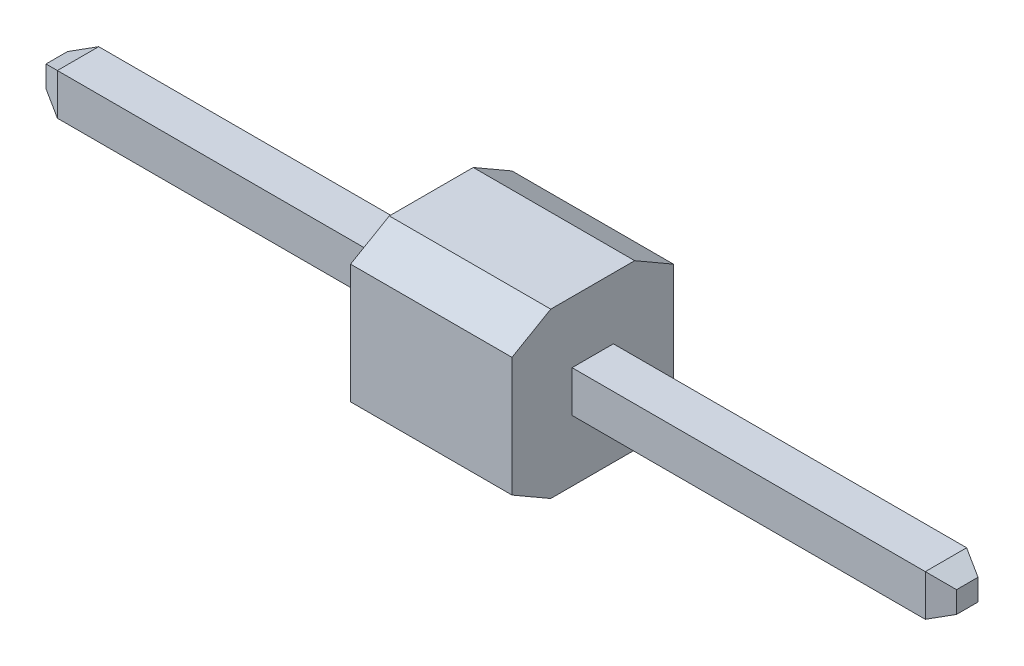
ISO-10303-21;
HEADER;
FILE_DESCRIPTION(('STEP AP214'),'2;1');
FILE_NAME('part.step','',(''),(''),'','','');
FILE_SCHEMA(('AUTOMOTIVE_DESIGN { 1 0 10303 214 1 1 1 1 }'));
ENDSEC;
DATA;
#1=APPLICATION_CONTEXT('core data for automotive mechanical design processes');
#2=APPLICATION_PROTOCOL_DEFINITION('international standard','automotive_design',2000,#1);
#3=PRODUCT_CONTEXT('',#1,'mechanical');
#4=PRODUCT('Part','Part','',(#3));
#5=PRODUCT_RELATED_PRODUCT_CATEGORY('part','',(#4));
#6=PRODUCT_DEFINITION_FORMATION('','',#4);
#7=PRODUCT_DEFINITION_CONTEXT('part definition',#1,'design');
#8=PRODUCT_DEFINITION('design','',#6,#7);
#9=PRODUCT_DEFINITION_SHAPE('','',#8);
#10=(LENGTH_UNIT() NAMED_UNIT(*) SI_UNIT(.MILLI.,.METRE.));
#11=(NAMED_UNIT(*) PLANE_ANGLE_UNIT() SI_UNIT($,.RADIAN.));
#12=(NAMED_UNIT(*) SI_UNIT($,.STERADIAN.) SOLID_ANGLE_UNIT());
#13=UNCERTAINTY_MEASURE_WITH_UNIT(LENGTH_MEASURE(1.E-05),#10,'distance_accuracy_value','');
#14=(GEOMETRIC_REPRESENTATION_CONTEXT(3) GLOBAL_UNCERTAINTY_ASSIGNED_CONTEXT((#13)) GLOBAL_UNIT_ASSIGNED_CONTEXT((#10,
#11,#12)) REPRESENTATION_CONTEXT('',''));
#15=CARTESIAN_POINT('',(0.,0.,0.));
#16=DIRECTION('',(0.,0.,1.));
#17=DIRECTION('',(1.,0.,0.));
#18=AXIS2_PLACEMENT_3D('',#15,#16,#17);
#19=CARTESIAN_POINT('',(5.42107472349216,4.7628784128063,0.629998634255617));
#20=DIRECTION('',(1.,4.37113882867379E-08,-4.37113882867379E-08));
#21=DIRECTION('',(-4.37113882867379E-08,1.,0.));
#22=AXIS2_PLACEMENT_3D('',#19,#20,#21);
#23=PLANE('',#22);
#24=DIRECTION('',(1.59994790123753E-08,0.50000000000019,0.866025403784329));
#25=VECTOR('',#24,1.);
#26=CARTESIAN_POINT('',(5.42107460050624,6.0064682512923,-0.940001365744382));
#27=LINE('',#26,#25);
#28=CARTESIAN_POINT('',(5.42107460050624,6.0064682512923,-0.940001365744382));
#29=VERTEX_POINT('',#28);
#30=CARTESIAN_POINT('',(5.421074611591,6.3528784128063,-0.340001365744383));
#31=VERTEX_POINT('',#30);
#32=EDGE_CURVE('E11',#29,#31,#27,.T.);
#33=ORIENTED_EDGE('',*,*,#32,.T.);
#34=DIRECTION('',(4.37113886966664E-08,0.,0.999999999999999));
#35=VECTOR('',#34,1.);
#36=CARTESIAN_POINT('',(5.421074611591,6.3528784128063,-0.340001365744383));
#37=LINE('',#36,#35);
#38=CARTESIAN_POINT('',(5.42107466841581,6.3528784128063,0.959998634255618));
#39=VERTEX_POINT('',#38);
#40=EDGE_CURVE('E304',#31,#39,#37,.T.);
#41=ORIENTED_EDGE('',*,*,#40,.T.);
#42=DIRECTION('',(5.97108656004285E-08,-0.500000000000189,0.866025403784328));
#43=VECTOR('',#42,1.);
#44=CARTESIAN_POINT('',(5.42107466841581,6.3528784128063,0.959998634255618));
#45=LINE('',#44,#43);
#46=CARTESIAN_POINT('',(5.42107470978471,6.0064682512923,1.55999863425562));
#47=VERTEX_POINT('',#46);
#48=EDGE_CURVE('E296',#39,#47,#45,.T.);
#49=ORIENTED_EDGE('',*,*,#48,.T.);
#50=DIRECTION('',(4.37113884815072E-08,-0.999999999999999,0.));
#51=VECTOR('',#50,1.);
#52=CARTESIAN_POINT('',(5.42107470978471,6.0064682512923,1.55999863425562));
#53=LINE('',#52,#51);
#54=CARTESIAN_POINT('',(5.4210747905275,4.15928857432031,1.55999863425562));
#55=VERTEX_POINT('',#54);
#56=EDGE_CURVE('E281',#47,#55,#53,.T.);
#57=ORIENTED_EDGE('',*,*,#56,.T.);
#58=DIRECTION('',(1.59994790123752E-08,0.500000000000192,0.866025403784328));
#59=VECTOR('',#58,1.);
#60=CARTESIAN_POINT('',(5.42107477944273,3.8128784128063,0.959998634255618));
#61=LINE('',#60,#59);
#62=CARTESIAN_POINT('',(5.42107477944273,3.8128784128063,0.959998634255618));
#63=VERTEX_POINT('',#62);
#64=EDGE_CURVE('E265',#63,#55,#61,.T.);
#65=ORIENTED_EDGE('',*,*,#64,.F.);
#66=DIRECTION('',(4.37113880134522E-08,0.,0.999999999999999));
#67=VECTOR('',#66,1.);
#68=CARTESIAN_POINT('',(5.42107472261793,3.8128784128063,-0.340001365744383));
#69=LINE('',#68,#67);
#70=CARTESIAN_POINT('',(5.42107472261793,3.8128784128063,-0.340001365744383));
#71=VERTEX_POINT('',#70);
#72=EDGE_CURVE('E248',#71,#63,#69,.T.);
#73=ORIENTED_EDGE('',*,*,#72,.F.);
#74=DIRECTION('',(5.97108668824036E-08,-0.500000000000187,0.866025403784328));
#75=VECTOR('',#74,1.);
#76=CARTESIAN_POINT('',(5.42107468124903,4.1592885743203,-0.940001365744382));
#77=LINE('',#76,#75);
#78=CARTESIAN_POINT('',(5.42107468124903,4.1592885743203,-0.940001365744382));
#79=VERTEX_POINT('',#78);
#80=EDGE_CURVE('E242',#79,#71,#77,.T.);
#81=ORIENTED_EDGE('',*,*,#80,.F.);
#82=DIRECTION('',(4.37113884815072E-08,-0.999999999999999,0.));
#83=VECTOR('',#82,1.);
#84=CARTESIAN_POINT('',(5.42107460050624,6.0064682512923,-0.940001365744382));
#85=LINE('',#84,#83);
#86=EDGE_CURVE('E236',#29,#79,#85,.T.);
#87=ORIENTED_EDGE('',*,*,#86,.F.);
#88=EDGE_LOOP('',(#33,#41,#49,#57,#65,#73,#81,#87));
#89=FACE_BOUND('',#88,.T.);
#90=DIRECTION('',(-4.37113886753159E-08,0.,-0.999999999999999));
#91=VECTOR('',#90,1.);
#92=CARTESIAN_POINT('',(5.42107469551687,5.4028784128063,0.629998634255617));
#93=LINE('',#92,#91);
#94=CARTESIAN_POINT('',(5.42107469551687,5.4028784128063,0.629998634255617));
#95=VERTEX_POINT('',#94);
#96=CARTESIAN_POINT('',(5.42107466754158,5.4028784128063,-0.0100013657443826));
#97=VERTEX_POINT('',#96);
#98=EDGE_CURVE('E302',#95,#97,#93,.T.);
#99=ORIENTED_EDGE('',*,*,#98,.T.);
#100=DIRECTION('',(-4.3711388675316E-08,0.999999999999999,0.));
#101=VECTOR('',#100,1.);
#102=CARTESIAN_POINT('',(5.42107469551687,4.7628784128063,-0.0100013657443826));
#103=LINE('',#102,#101);
#104=CARTESIAN_POINT('',(5.42107469551687,4.7628784128063,-0.0100013657443826));
#105=VERTEX_POINT('',#104);
#106=EDGE_CURVE('E293',#105,#97,#103,.T.);
#107=ORIENTED_EDGE('',*,*,#106,.F.);
#108=DIRECTION('',(-4.37113886753159E-08,0.,-0.999999999999999));
#109=VECTOR('',#108,1.);
#110=CARTESIAN_POINT('',(5.42107472349216,4.7628784128063,0.629998634255617));
#111=LINE('',#110,#109);
#112=CARTESIAN_POINT('',(5.42107472349216,4.7628784128063,0.629998634255617));
#113=VERTEX_POINT('',#112);
#114=EDGE_CURVE('E278',#113,#105,#111,.T.);
#115=ORIENTED_EDGE('',*,*,#114,.F.);
#116=DIRECTION('',(-4.3711388675316E-08,0.999999999999999,0.));
#117=VECTOR('',#116,1.);
#118=CARTESIAN_POINT('',(5.42107472349216,4.7628784128063,0.629998634255617));
#119=LINE('',#118,#117);
#120=EDGE_CURVE('E263',#113,#95,#119,.T.);
#121=ORIENTED_EDGE('',*,*,#120,.T.);
#122=EDGE_LOOP('',(#99,#107,#115,#121));
#123=FACE_BOUND('',#122,.T.);
#124=ADVANCED_FACE('F17',(#89,#123),#23,.T.);
#125=CARTESIAN_POINT('',(2.92107472349216,4.76287830352783,0.629998743534088));
#126=DIRECTION('',(1.,4.37113882867379E-08,-4.37113882867379E-08));
#127=DIRECTION('',(-4.37113882867379E-08,1.,0.));
#128=AXIS2_PLACEMENT_3D('',#125,#126,#127);
#129=PLANE('',#128);
#130=DIRECTION('',(1.59994790123753E-08,0.50000000000019,0.866025403784329));
#131=VECTOR('',#130,1.);
#132=CARTESIAN_POINT('',(2.92107460050624,6.00646814201383,-0.940001256465912));
#133=LINE('',#132,#131);
#134=CARTESIAN_POINT('',(2.92107460050624,6.00646814201383,-0.940001256465912));
#135=VERTEX_POINT('',#134);
#136=CARTESIAN_POINT('',(2.921074611591,6.35287830352783,-0.340001256465912));
#137=VERTEX_POINT('',#136);
#138=EDGE_CURVE('E24',#135,#137,#133,.T.);
#139=ORIENTED_EDGE('',*,*,#138,.F.);
#140=DIRECTION('',(4.37113884815072E-08,-0.999999999999999,0.));
#141=VECTOR('',#140,1.);
#142=CARTESIAN_POINT('',(2.92107460050624,6.00646814201383,-0.940001256465912));
#143=LINE('',#142,#141);
#144=CARTESIAN_POINT('',(2.92107468124903,4.15928846504183,-0.940001256465912));
#145=VERTEX_POINT('',#144);
#146=EDGE_CURVE('E300',#135,#145,#143,.T.);
#147=ORIENTED_EDGE('',*,*,#146,.T.);
#148=DIRECTION('',(5.97108668824036E-08,-0.500000000000187,0.866025403784328));
#149=VECTOR('',#148,1.);
#150=CARTESIAN_POINT('',(2.92107468124903,4.15928846504183,-0.940001256465912));
#151=LINE('',#150,#149);
#152=CARTESIAN_POINT('',(2.92107472261793,3.81287830352783,-0.340001256465912));
#153=VERTEX_POINT('',#152);
#154=EDGE_CURVE('E286',#145,#153,#151,.T.);
#155=ORIENTED_EDGE('',*,*,#154,.T.);
#156=DIRECTION('',(4.37113880134522E-08,0.,0.999999999999999));
#157=VECTOR('',#156,1.);
#158=CARTESIAN_POINT('',(2.92107472261793,3.81287830352783,-0.340001256465912));
#159=LINE('',#158,#157);
#160=CARTESIAN_POINT('',(2.92107477944273,3.81287830352783,0.959998743534088));
#161=VERTEX_POINT('',#160);
#162=EDGE_CURVE('E271',#153,#161,#159,.T.);
#163=ORIENTED_EDGE('',*,*,#162,.T.);
#164=DIRECTION('',(1.59994790123752E-08,0.500000000000192,0.866025403784328));
#165=VECTOR('',#164,1.);
#166=CARTESIAN_POINT('',(2.92107477944273,3.81287830352783,0.959998743534088));
#167=LINE('',#166,#165);
#168=CARTESIAN_POINT('',(2.9210747905275,4.15928846504183,1.55999874353409));
#169=VERTEX_POINT('',#168);
#170=EDGE_CURVE('E253',#161,#169,#167,.T.);
#171=ORIENTED_EDGE('',*,*,#170,.T.);
#172=DIRECTION('',(4.37113884815072E-08,-0.999999999999999,0.));
#173=VECTOR('',#172,1.);
#174=CARTESIAN_POINT('',(2.92107470978471,6.00646814201383,1.55999874353409));
#175=LINE('',#174,#173);
#176=CARTESIAN_POINT('',(2.92107470978471,6.00646814201383,1.55999874353409));
#177=VERTEX_POINT('',#176);
#178=EDGE_CURVE('E261',#177,#169,#175,.T.);
#179=ORIENTED_EDGE('',*,*,#178,.F.);
#180=DIRECTION('',(5.9710866241416E-08,-0.500000000000189,0.866025403784328));
#181=VECTOR('',#180,1.);
#182=CARTESIAN_POINT('',(2.92107466841581,6.35287830352783,0.959998743534088));
#183=LINE('',#182,#181);
#184=CARTESIAN_POINT('',(2.92107466841581,6.35287830352783,0.959998743534088));
#185=VERTEX_POINT('',#184);
#186=EDGE_CURVE('E276',#185,#177,#183,.T.);
#187=ORIENTED_EDGE('',*,*,#186,.F.);
#188=DIRECTION('',(4.37113883550593E-08,0.,0.999999999999999));
#189=VECTOR('',#188,1.);
#190=CARTESIAN_POINT('',(2.921074611591,6.35287830352783,-0.340001256465912));
#191=LINE('',#190,#189);
#192=EDGE_CURVE('E291',#137,#185,#191,.T.);
#193=ORIENTED_EDGE('',*,*,#192,.F.);
#194=EDGE_LOOP('',(#139,#147,#155,#163,#171,#179,#187,#193));
#195=FACE_BOUND('',#194,.T.);
#196=DIRECTION('',(-4.37113879814266E-08,0.999999999999999,0.));
#197=VECTOR('',#196,1.);
#198=CARTESIAN_POINT('',(2.92107469551687,4.76287830352783,-0.0100012564659119));
#199=LINE('',#198,#197);
#200=CARTESIAN_POINT('',(2.92107469551687,4.76287830352783,-0.0100012564659119));
#201=VERTEX_POINT('',#200);
#202=CARTESIAN_POINT('',(2.92107466754158,5.40287830352783,-0.0100012564659119));
#203=VERTEX_POINT('',#202);
#204=EDGE_CURVE('E298',#201,#203,#199,.T.);
#205=ORIENTED_EDGE('',*,*,#204,.T.);
#206=DIRECTION('',(-4.37113879814266E-08,0.,-0.999999999999999));
#207=VECTOR('',#206,1.);
#208=CARTESIAN_POINT('',(2.92107469551687,5.40287830352783,0.629998743534088));
#209=LINE('',#208,#207);
#210=CARTESIAN_POINT('',(2.92107469551687,5.40287830352783,0.629998743534088));
#211=VERTEX_POINT('',#210);
#212=EDGE_CURVE('E283',#211,#203,#209,.T.);
#213=ORIENTED_EDGE('',*,*,#212,.F.);
#214=DIRECTION('',(-4.3711388675316E-08,0.999999999999999,0.));
#215=VECTOR('',#214,1.);
#216=CARTESIAN_POINT('',(2.92107472349216,4.76287830352783,0.629998743534088));
#217=LINE('',#216,#215);
#218=CARTESIAN_POINT('',(2.92107472349216,4.76287830352783,0.629998743534088));
#219=VERTEX_POINT('',#218);
#220=EDGE_CURVE('E268',#219,#211,#217,.T.);
#221=ORIENTED_EDGE('',*,*,#220,.F.);
#222=DIRECTION('',(-4.37113886753159E-08,0.,-0.999999999999999));
#223=VECTOR('',#222,1.);
#224=CARTESIAN_POINT('',(2.92107472349216,4.76287830352783,0.629998743534088));
#225=LINE('',#224,#223);
#226=EDGE_CURVE('E251',#219,#201,#225,.T.);
#227=ORIENTED_EDGE('',*,*,#226,.T.);
#228=EDGE_LOOP('',(#205,#213,#221,#227));
#229=FACE_BOUND('',#228,.T.);
#230=ADVANCED_FACE('F314',(#195,#229),#129,.F.);
#231=CARTESIAN_POINT('',(5.42107460050624,6.0064682512923,-0.940001365744382));
#232=DIRECTION('',(5.97108668343731E-08,-0.866025403784328,0.50000000000019));
#233=DIRECTION('',(-1.59994785476185E-08,-0.500000000000192,-0.866025403784329));
#234=AXIS2_PLACEMENT_3D('',#231,#232,#233);
#235=PLANE('',#234);
#236=ORIENTED_EDGE('',*,*,#138,.T.);
#237=DIRECTION('',(-0.999999999999998,-4.37113886420092E-08,4.37113883755557E-08));
#238=VECTOR('',#237,1.);
#239=CARTESIAN_POINT('',(5.421074611591,6.3528784128063,-0.340001365744383));
#240=LINE('',#239,#238);
#241=EDGE_CURVE('E288',#31,#137,#240,.T.);
#242=ORIENTED_EDGE('',*,*,#241,.F.);
#243=ORIENTED_EDGE('',*,*,#32,.F.);
#244=DIRECTION('',(-0.999999999999998,-4.37113889972806E-08,4.37113881091022E-08));
#245=VECTOR('',#244,1.);
#246=CARTESIAN_POINT('',(5.42107460050624,6.0064682512923,-0.940001365744382));
#247=LINE('',#246,#245);
#248=EDGE_CURVE('E256',#29,#135,#247,.T.);
#249=ORIENTED_EDGE('',*,*,#248,.T.);
#250=EDGE_LOOP('',(#236,#242,#243,#249));
#251=FACE_BOUND('',#250,.T.);
#252=ADVANCED_FACE('F306',(#251),#235,.F.);
#253=CARTESIAN_POINT('',(5.421074611591,6.3528784128063,-0.340001365744383));
#254=DIRECTION('',(4.37113882867379E-08,-1.,0.));
#255=DIRECTION('',(1.,4.37113882867379E-08,-4.37113882867379E-08));
#256=AXIS2_PLACEMENT_3D('',#253,#254,#255);
#257=PLANE('',#256);
#258=ORIENTED_EDGE('',*,*,#192,.T.);
#259=DIRECTION('',(-0.999999999999998,-4.37113886420092E-08,4.37113882867378E-08));
#260=VECTOR('',#259,1.);
#261=CARTESIAN_POINT('',(5.42107466841581,6.3528784128063,0.959998634255618));
#262=LINE('',#261,#260);
#263=EDGE_CURVE('E273',#39,#185,#262,.T.);
#264=ORIENTED_EDGE('',*,*,#263,.F.);
#265=ORIENTED_EDGE('',*,*,#40,.F.);
#266=ORIENTED_EDGE('',*,*,#241,.T.);
#267=EDGE_LOOP('',(#258,#264,#265,#266));
#268=FACE_BOUND('',#267,.T.);
#269=ADVANCED_FACE('F311',(#268),#257,.F.);
#270=CARTESIAN_POINT('',(5.42107466841581,6.3528784128063,0.959998634255618));
#271=DIRECTION('',(1.59994785476185E-08,-0.86602540378433,-0.50000000000019));
#272=DIRECTION('',(-5.97108668343731E-08,0.500000000000188,-0.866025403784329));
#273=AXIS2_PLACEMENT_3D('',#270,#271,#272);
#274=PLANE('',#273);
#275=ORIENTED_EDGE('',*,*,#186,.T.);
#276=DIRECTION('',(-0.999999999999998,-4.37113889972806E-08,4.37113882867378E-08));
#277=VECTOR('',#276,1.);
#278=CARTESIAN_POINT('',(5.42107470978471,6.0064682512923,1.55999863425562));
#279=LINE('',#278,#277);
#280=EDGE_CURVE('E258',#47,#177,#279,.T.);
#281=ORIENTED_EDGE('',*,*,#280,.F.);
#282=ORIENTED_EDGE('',*,*,#48,.F.);
#283=ORIENTED_EDGE('',*,*,#263,.T.);
#284=EDGE_LOOP('',(#275,#281,#282,#283));
#285=FACE_BOUND('',#284,.T.);
#286=ADVANCED_FACE('F319',(#285),#274,.F.);
#287=CARTESIAN_POINT('',(5.42107470978471,6.0064682512923,1.55999863425562));
#288=DIRECTION('',(-4.37113882867379E-08,0.,-1.));
#289=DIRECTION('',(-1.,-4.37113882867379E-08,4.37113882867379E-08));
#290=AXIS2_PLACEMENT_3D('',#287,#288,#289);
#291=PLANE('',#290);
#292=ORIENTED_EDGE('',*,*,#178,.T.);
#293=DIRECTION('',(-0.999999999999998,-4.37113882867378E-08,4.37113882867378E-08));
#294=VECTOR('',#293,1.);
#295=CARTESIAN_POINT('',(5.4210747905275,4.15928857432031,1.55999863425562));
#296=LINE('',#295,#294);
#297=EDGE_CURVE('E245',#55,#169,#296,.T.);
#298=ORIENTED_EDGE('',*,*,#297,.F.);
#299=ORIENTED_EDGE('',*,*,#56,.F.);
#300=ORIENTED_EDGE('',*,*,#280,.T.);
#301=EDGE_LOOP('',(#292,#298,#299,#300));
#302=FACE_BOUND('',#301,.T.);
#303=ADVANCED_FACE('F326',(#302),#291,.F.);
#304=CARTESIAN_POINT('',(5.42107477944273,3.8128784128063,0.959998634255618));
#305=DIRECTION('',(5.97108668343731E-08,-0.866025403784328,0.50000000000019));
#306=DIRECTION('',(-1.59994785476185E-08,-0.500000000000192,-0.866025403784329));
#307=AXIS2_PLACEMENT_3D('',#304,#305,#306);
#308=PLANE('',#307);
#309=ORIENTED_EDGE('',*,*,#170,.F.);
#310=DIRECTION('',(-0.999999999999998,-4.37113882867378E-08,4.37113882867378E-08));
#311=VECTOR('',#310,1.);
#312=CARTESIAN_POINT('',(5.42107477944273,3.8128784128063,0.959998634255618));
#313=LINE('',#312,#311);
#314=EDGE_CURVE('E239',#63,#161,#313,.T.);
#315=ORIENTED_EDGE('',*,*,#314,.F.);
#316=ORIENTED_EDGE('',*,*,#64,.T.);
#317=ORIENTED_EDGE('',*,*,#297,.T.);
#318=EDGE_LOOP('',(#309,#315,#316,#317));
#319=FACE_BOUND('',#318,.T.);
#320=ADVANCED_FACE('F329',(#319),#308,.T.);
#321=CARTESIAN_POINT('',(5.42107472261793,3.8128784128063,-0.340001365744383));
#322=DIRECTION('',(4.37113882867379E-08,-1.,0.));
#323=DIRECTION('',(1.,4.37113882867379E-08,-4.37113882867379E-08));
#324=AXIS2_PLACEMENT_3D('',#321,#322,#323);
#325=PLANE('',#324);
#326=ORIENTED_EDGE('',*,*,#162,.F.);
#327=DIRECTION('',(-0.999999999999998,-4.37113882867378E-08,4.37113883755557E-08));
#328=VECTOR('',#327,1.);
#329=CARTESIAN_POINT('',(5.42107472261793,3.8128784128063,-0.340001365744383));
#330=LINE('',#329,#328);
#331=EDGE_CURVE('E233',#71,#153,#330,.T.);
#332=ORIENTED_EDGE('',*,*,#331,.F.);
#333=ORIENTED_EDGE('',*,*,#72,.T.);
#334=ORIENTED_EDGE('',*,*,#314,.T.);
#335=EDGE_LOOP('',(#326,#332,#333,#334));
#336=FACE_BOUND('',#335,.T.);
#337=ADVANCED_FACE('F333',(#336),#325,.T.);
#338=CARTESIAN_POINT('',(5.42107468124903,4.1592885743203,-0.940001365744382));
#339=DIRECTION('',(1.59994785476185E-08,-0.86602540378433,-0.50000000000019));
#340=DIRECTION('',(-5.97108668343731E-08,0.500000000000188,-0.866025403784329));
#341=AXIS2_PLACEMENT_3D('',#338,#339,#340);
#342=PLANE('',#341);
#343=ORIENTED_EDGE('',*,*,#154,.F.);
#344=DIRECTION('',(-0.999999999999998,-4.37113882867378E-08,4.37113881091022E-08));
#345=VECTOR('',#344,1.);
#346=CARTESIAN_POINT('',(5.42107468124903,4.1592885743203,-0.940001365744382));
#347=LINE('',#346,#345);
#348=EDGE_CURVE('E230',#79,#145,#347,.T.);
#349=ORIENTED_EDGE('',*,*,#348,.F.);
#350=ORIENTED_EDGE('',*,*,#80,.T.);
#351=ORIENTED_EDGE('',*,*,#331,.T.);
#352=EDGE_LOOP('',(#343,#349,#350,#351));
#353=FACE_BOUND('',#352,.T.);
#354=ADVANCED_FACE('F337',(#353),#342,.T.);
#355=CARTESIAN_POINT('',(5.42107460050624,6.0064682512923,-0.940001365744382));
#356=DIRECTION('',(-4.37113882867379E-08,0.,-1.));
#357=DIRECTION('',(-4.37113882867379E-08,1.,0.));
#358=AXIS2_PLACEMENT_3D('',#355,#356,#357);
#359=PLANE('',#358);
#360=ORIENTED_EDGE('',*,*,#146,.F.);
#361=ORIENTED_EDGE('',*,*,#248,.F.);
#362=ORIENTED_EDGE('',*,*,#86,.T.);
#363=ORIENTED_EDGE('',*,*,#348,.T.);
#364=EDGE_LOOP('',(#360,#361,#362,#363));
#365=FACE_BOUND('',#364,.T.);
#366=ADVANCED_FACE('F339',(#365),#359,.T.);
#367=CARTESIAN_POINT('',(-2.87892527650784,4.76287805000178,0.62999899706014));
#368=DIRECTION('',(-1.,-4.37113882867379E-08,4.37113882867379E-08));
#369=DIRECTION('',(4.37113882867379E-08,-1.,0.));
#370=AXIS2_PLACEMENT_3D('',#367,#368,#369);
#371=PLANE('',#370);
#372=DIRECTION('',(4.37113927480284E-08,-0.999999999999999,0.));
#373=VECTOR('',#372,1.);
#374=CARTESIAN_POINT('',(-2.87892531900567,5.24899652281078,0.14388052425114));
#375=LINE('',#374,#373);
#376=CARTESIAN_POINT('',(-2.87892531900567,5.24899652281078,0.14388052425114));
#377=VERTEX_POINT('',#376);
#378=CARTESIAN_POINT('',(-2.87892530448313,4.91675957719278,0.14388052425114));
#379=VERTEX_POINT('',#378);
#380=EDGE_CURVE('E228',#377,#379,#375,.T.);
#381=ORIENTED_EDGE('',*,*,#380,.T.);
#382=DIRECTION('',(4.37113874013716E-08,0.,0.999999999999999));
#383=VECTOR('',#382,1.);
#384=CARTESIAN_POINT('',(-2.87892530448313,4.91675957719278,0.14388052425114));
#385=LINE('',#384,#383);
#386=CARTESIAN_POINT('',(-2.8789252899606,4.91675957719278,0.47611746986914));
#387=VERTEX_POINT('',#386);
#388=EDGE_CURVE('E223',#379,#387,#385,.T.);
#389=ORIENTED_EDGE('',*,*,#388,.T.);
#390=DIRECTION('',(-4.37113900747E-08,0.999999999999999,0.));
#391=VECTOR('',#390,1.);
#392=CARTESIAN_POINT('',(-2.87892528996059,4.91675957719278,0.47611746986914));
#393=LINE('',#392,#391);
#394=CARTESIAN_POINT('',(-2.87892530448313,5.24899652281078,0.47611746986914));
#395=VERTEX_POINT('',#394);
#396=EDGE_CURVE('E215',#387,#395,#393,.T.);
#397=ORIENTED_EDGE('',*,*,#396,.T.);
#398=DIRECTION('',(-4.37113820547151E-08,0.,-0.999999999999999));
#399=VECTOR('',#398,1.);
#400=CARTESIAN_POINT('',(-2.87892530448313,5.24899652281078,0.47611746986914));
#401=LINE('',#400,#399);
#402=EDGE_CURVE('E207',#395,#377,#401,.T.);
#403=ORIENTED_EDGE('',*,*,#402,.T.);
#404=EDGE_LOOP('',(#381,#389,#397,#403));
#405=FACE_BOUND('',#404,.T.);
#406=ADVANCED_FACE('F341',(#405),#371,.T.);
#407=CARTESIAN_POINT('',(-2.87892527650784,4.76287805000178,0.62999899706014));
#408=DIRECTION('',(4.37113882867379E-08,-1.,0.));
#409=DIRECTION('',(-4.37113882867379E-08,0.,-1.));
#410=AXIS2_PLACEMENT_3D('',#407,#408,#409);
#411=PLANE('',#410);
#412=DIRECTION('',(0.999999999999998,4.37113888452998E-08,-4.37113882769955E-08));
#413=VECTOR('',#412,1.);
#414=CARTESIAN_POINT('',(-2.54892527650784,4.76287806442654,0.629998982635382));
#415=LINE('',#414,#413);
#416=CARTESIAN_POINT('',(-2.54892527650784,4.76287806442654,0.629998982635382));
#417=VERTEX_POINT('',#416);
#418=EDGE_CURVE('E225',#417,#219,#415,.T.);
#419=ORIENTED_EDGE('',*,*,#418,.F.);
#420=DIRECTION('',(-4.37113886753159E-08,0.,-0.999999999999999));
#421=VECTOR('',#420,1.);
#422=CARTESIAN_POINT('',(-2.54892527650784,4.76287806442654,0.629998982635382));
#423=LINE('',#422,#421);
#424=CARTESIAN_POINT('',(-2.54892530448313,4.76287806442654,-0.010001017364618));
#425=VERTEX_POINT('',#424);
#426=EDGE_CURVE('E217',#417,#425,#423,.T.);
#427=ORIENTED_EDGE('',*,*,#426,.T.);
#428=DIRECTION('',(0.999999999999998,4.37113888452998E-08,-4.37113882161057E-08));
#429=VECTOR('',#428,1.);
#430=CARTESIAN_POINT('',(-2.54892530448313,4.76287806442654,-0.010001017364618));
#431=LINE('',#430,#429);
#432=EDGE_CURVE('E220',#425,#201,#431,.T.);
#433=ORIENTED_EDGE('',*,*,#432,.T.);
#434=ORIENTED_EDGE('',*,*,#226,.F.);
#435=EDGE_LOOP('',(#419,#427,#433,#434));
#436=FACE_BOUND('',#435,.T.);
#437=ADVANCED_FACE('F348',(#436),#411,.T.);
#438=CARTESIAN_POINT('',(-2.87892530448313,4.76287805000178,-0.0100010029398598));
#439=DIRECTION('',(-4.37113882867379E-08,0.,-1.));
#440=DIRECTION('',(-1.,-4.37113882867379E-08,4.37113882867379E-08));
#441=AXIS2_PLACEMENT_3D('',#438,#439,#440);
#442=PLANE('',#441);
#443=ORIENTED_EDGE('',*,*,#432,.F.);
#444=DIRECTION('',(-4.3711388675316E-08,0.999999999999999,0.));
#445=VECTOR('',#444,1.);
#446=CARTESIAN_POINT('',(-2.54892530448313,4.76287806442654,-0.010001017364618));
#447=LINE('',#446,#445);
#448=CARTESIAN_POINT('',(-2.54892533245842,5.40287806442654,-0.010001017364618));
#449=VERTEX_POINT('',#448);
#450=EDGE_CURVE('E209',#425,#449,#447,.T.);
#451=ORIENTED_EDGE('',*,*,#450,.T.);
#452=DIRECTION('',(0.999999999999998,4.37113877086912E-08,-4.37113882161057E-08));
#453=VECTOR('',#452,1.);
#454=CARTESIAN_POINT('',(-2.54892533245842,5.40287806442654,-0.010001017364618));
#455=LINE('',#454,#453);
#456=EDGE_CURVE('E212',#449,#203,#455,.T.);
#457=ORIENTED_EDGE('',*,*,#456,.T.);
#458=ORIENTED_EDGE('',*,*,#204,.F.);
#459=EDGE_LOOP('',(#443,#451,#457,#458));
#460=FACE_BOUND('',#459,.T.);
#461=ADVANCED_FACE('F424',(#460),#442,.T.);
#462=CARTESIAN_POINT('',(-2.87892530448313,5.40287805000178,0.62999899706014));
#463=DIRECTION('',(4.37113882867379E-08,-1.,0.));
#464=DIRECTION('',(-4.37113882867379E-08,0.,-1.));
#465=AXIS2_PLACEMENT_3D('',#462,#463,#464);
#466=PLANE('',#465);
#467=ORIENTED_EDGE('',*,*,#456,.F.);
#468=DIRECTION('',(4.37113900630947E-08,0.,0.999999999999999));
#469=VECTOR('',#468,1.);
#470=CARTESIAN_POINT('',(-2.54892533245842,5.40287806442654,-0.010001017364618));
#471=LINE('',#470,#469);
#472=CARTESIAN_POINT('',(-2.54892530448313,5.40287806442654,0.629998982635382));
#473=VERTEX_POINT('',#472);
#474=EDGE_CURVE('E201',#449,#473,#471,.T.);
#475=ORIENTED_EDGE('',*,*,#474,.T.);
#476=DIRECTION('',(0.999999999999998,4.37113877086912E-08,-4.37113882769955E-08));
#477=VECTOR('',#476,1.);
#478=CARTESIAN_POINT('',(-2.54892530448313,5.40287806442654,0.629998982635382));
#479=LINE('',#478,#477);
#480=EDGE_CURVE('E204',#473,#211,#479,.T.);
#481=ORIENTED_EDGE('',*,*,#480,.T.);
#482=ORIENTED_EDGE('',*,*,#212,.T.);
#483=EDGE_LOOP('',(#467,#475,#481,#482));
#484=FACE_BOUND('',#483,.T.);
#485=ADVANCED_FACE('F421',(#484),#466,.F.);
#486=CARTESIAN_POINT('',(-2.87892527650784,4.76287805000178,0.62999899706014));
#487=DIRECTION('',(-4.37113882867379E-08,0.,-1.));
#488=DIRECTION('',(-1.,-4.37113882867379E-08,4.37113882867379E-08));
#489=AXIS2_PLACEMENT_3D('',#486,#487,#488);
#490=PLANE('',#489);
#491=ORIENTED_EDGE('',*,*,#480,.F.);
#492=DIRECTION('',(4.37113900630949E-08,-0.999999999999999,0.));
#493=VECTOR('',#492,1.);
#494=CARTESIAN_POINT('',(-2.54892530448313,5.40287806442654,0.629998982635382));
#495=LINE('',#494,#493);
#496=EDGE_CURVE('E196',#473,#417,#495,.T.);
#497=ORIENTED_EDGE('',*,*,#496,.T.);
#498=ORIENTED_EDGE('',*,*,#418,.T.);
#499=ORIENTED_EDGE('',*,*,#220,.T.);
#500=EDGE_LOOP('',(#491,#497,#498,#499));
#501=FACE_BOUND('',#500,.T.);
#502=ADVANCED_FACE('F376',(#501),#490,.F.);
#503=CARTESIAN_POINT('',(-2.87892527650784,4.76287805000178,0.62999899706014));
#504=DIRECTION('',(-4.37113882867379E-08,0.,-1.));
#505=DIRECTION('',(-1.,-4.37113882867379E-08,4.37113882867379E-08));
#506=AXIS2_PLACEMENT_3D('',#503,#504,#505);
#507=PLANE('',#506);
#508=DIRECTION('',(0.999999999999998,4.37113909561443E-08,-4.37113882769955E-08));
#509=VECTOR('',#508,1.);
#510=CARTESIAN_POINT('',(5.42107472349216,4.7628784128063,0.629998634255617));
#511=LINE('',#510,#509);
#512=CARTESIAN_POINT('',(10.8910747234922,4.7628786519076,0.629998395154324));
#513=VERTEX_POINT('',#512);
#514=EDGE_CURVE('E199',#113,#513,#511,.T.);
#515=ORIENTED_EDGE('',*,*,#514,.T.);
#516=DIRECTION('',(-4.37113900630947E-08,0.999999999999999,0.));
#517=VECTOR('',#516,1.);
#518=CARTESIAN_POINT('',(10.8910747234922,4.7628786519076,0.629998395154324));
#519=LINE('',#518,#517);
#520=CARTESIAN_POINT('',(10.8910746955169,5.4028786519076,0.629998395154324));
#521=VERTEX_POINT('',#520);
#522=EDGE_CURVE('E191',#513,#521,#519,.T.);
#523=ORIENTED_EDGE('',*,*,#522,.T.);
#524=DIRECTION('',(0.999999999999998,4.37113909561443E-08,-4.37113882769955E-08));
#525=VECTOR('',#524,1.);
#526=CARTESIAN_POINT('',(5.42107469551687,5.4028784128063,0.629998634255617));
#527=LINE('',#526,#525);
#528=EDGE_CURVE('E194',#95,#521,#527,.T.);
#529=ORIENTED_EDGE('',*,*,#528,.F.);
#530=ORIENTED_EDGE('',*,*,#120,.F.);
#531=EDGE_LOOP('',(#515,#523,#529,#530));
#532=FACE_BOUND('',#531,.T.);
#533=ADVANCED_FACE('F367',(#532),#507,.F.);
#534=CARTESIAN_POINT('',(-2.87892530448313,5.40287805000178,0.62999899706014));
#535=DIRECTION('',(4.37113882867379E-08,-1.,0.));
#536=DIRECTION('',(-4.37113882867379E-08,0.,-1.));
#537=AXIS2_PLACEMENT_3D('',#534,#535,#536);
#538=PLANE('',#537);
#539=ORIENTED_EDGE('',*,*,#528,.T.);
#540=DIRECTION('',(-4.37113900630947E-08,0.,-0.999999999999999));
#541=VECTOR('',#540,1.);
#542=CARTESIAN_POINT('',(10.8910746955169,5.4028786519076,0.629998395154324));
#543=LINE('',#542,#541);
#544=CARTESIAN_POINT('',(10.8910746675416,5.4028786519076,-0.0100016048456765));
#545=VERTEX_POINT('',#544);
#546=EDGE_CURVE('E186',#521,#545,#543,.T.);
#547=ORIENTED_EDGE('',*,*,#546,.T.);
#548=DIRECTION('',(0.999999999999998,4.37113909561443E-08,-4.37113881146228E-08));
#549=VECTOR('',#548,1.);
#550=CARTESIAN_POINT('',(5.42107466754158,5.4028784128063,-0.0100013657443823));
#551=LINE('',#550,#549);
#552=EDGE_CURVE('E189',#97,#545,#551,.T.);
#553=ORIENTED_EDGE('',*,*,#552,.F.);
#554=ORIENTED_EDGE('',*,*,#98,.F.);
#555=EDGE_LOOP('',(#539,#547,#553,#554));
#556=FACE_BOUND('',#555,.T.);
#557=ADVANCED_FACE('F364',(#556),#538,.F.);
#558=CARTESIAN_POINT('',(-2.87892530448313,4.76287805000178,-0.0100010029398598));
#559=DIRECTION('',(-4.37113882867379E-08,0.,-1.));
#560=DIRECTION('',(-1.,-4.37113882867379E-08,4.37113882867379E-08));
#561=AXIS2_PLACEMENT_3D('',#558,#559,#560);
#562=PLANE('',#561);
#563=ORIENTED_EDGE('',*,*,#552,.T.);
#564=DIRECTION('',(4.37113872875373E-08,-0.999999999999999,0.));
#565=VECTOR('',#564,1.);
#566=CARTESIAN_POINT('',(10.8910746675416,5.40287865190759,-0.0100016048456764));
#567=LINE('',#566,#565);
#568=CARTESIAN_POINT('',(10.8910746955169,4.7628786519076,-0.0100016048456765));
#569=VERTEX_POINT('',#568);
#570=EDGE_CURVE('E176',#545,#569,#567,.T.);
#571=ORIENTED_EDGE('',*,*,#570,.T.);
#572=DIRECTION('',(0.999999999999998,4.37113909561443E-08,-4.37113881146228E-08));
#573=VECTOR('',#572,1.);
#574=CARTESIAN_POINT('',(5.42107469551687,4.7628784128063,-0.0100013657443823));
#575=LINE('',#574,#573);
#576=EDGE_CURVE('E179',#105,#569,#575,.T.);
#577=ORIENTED_EDGE('',*,*,#576,.F.);
#578=ORIENTED_EDGE('',*,*,#106,.T.);
#579=EDGE_LOOP('',(#563,#571,#577,#578));
#580=FACE_BOUND('',#579,.T.);
#581=ADVANCED_FACE('F366',(#580),#562,.T.);
#582=CARTESIAN_POINT('',(-2.87892527650784,4.76287805000178,0.62999899706014));
#583=DIRECTION('',(4.37113882867379E-08,-1.,0.));
#584=DIRECTION('',(-4.37113882867379E-08,0.,-1.));
#585=AXIS2_PLACEMENT_3D('',#582,#583,#584);
#586=PLANE('',#585);
#587=ORIENTED_EDGE('',*,*,#576,.T.);
#588=DIRECTION('',(4.37113900630947E-08,0.,0.999999999999999));
#589=VECTOR('',#588,1.);
#590=CARTESIAN_POINT('',(10.8910746955169,4.7628786519076,-0.0100016048456765));
#591=LINE('',#590,#589);
#592=EDGE_CURVE('E167',#569,#513,#591,.T.);
#593=ORIENTED_EDGE('',*,*,#592,.T.);
#594=ORIENTED_EDGE('',*,*,#514,.F.);
#595=ORIENTED_EDGE('',*,*,#114,.T.);
#596=EDGE_LOOP('',(#587,#593,#594,#595));
#597=FACE_BOUND('',#596,.T.);
#598=ADVANCED_FACE('F373',(#597),#586,.T.);
#599=CARTESIAN_POINT('',(11.2210747234922,4.76287866633235,0.629998380729565));
#600=DIRECTION('',(-1.,-4.37113882867379E-08,4.37113882867379E-08));
#601=DIRECTION('',(4.37113882867379E-08,-1.,0.));
#602=AXIS2_PLACEMENT_3D('',#599,#600,#601);
#603=PLANE('',#602);
#604=DIRECTION('',(-4.37113927480283E-08,0.999999999999999,0.));
#605=VECTOR('',#604,1.);
#606=CARTESIAN_POINT('',(11.2210746955169,4.91676019352335,0.143879907920565));
#607=LINE('',#606,#605);
#608=CARTESIAN_POINT('',(11.2210746955169,4.91676019352335,0.143879907920565));
#609=VERTEX_POINT('',#608);
#610=CARTESIAN_POINT('',(11.2210746809943,5.24899713914135,0.143879907920565));
#611=VERTEX_POINT('',#610);
#612=EDGE_CURVE('E153',#609,#611,#607,.T.);
#613=ORIENTED_EDGE('',*,*,#612,.T.);
#614=DIRECTION('',(4.37113927480282E-08,0.,0.999999999999999));
#615=VECTOR('',#614,1.);
#616=CARTESIAN_POINT('',(11.2210746809943,5.24899713914135,0.143879907920565));
#617=LINE('',#616,#615);
#618=CARTESIAN_POINT('',(11.2210746955169,5.24899713914135,0.476116853538565));
#619=VERTEX_POINT('',#618);
#620=EDGE_CURVE('E395',#611,#619,#617,.T.);
#621=ORIENTED_EDGE('',*,*,#620,.T.);
#622=DIRECTION('',(4.37113820547153E-08,-0.999999999999999,0.));
#623=VECTOR('',#622,1.);
#624=CARTESIAN_POINT('',(11.2210746955169,5.24899713914135,0.476116853538565));
#625=LINE('',#624,#623);
#626=CARTESIAN_POINT('',(11.2210747100394,4.91676019352335,0.476116853538565));
#627=VERTEX_POINT('',#626);
#628=EDGE_CURVE('E156',#619,#627,#625,.T.);
#629=ORIENTED_EDGE('',*,*,#628,.T.);
#630=DIRECTION('',(-4.37113927480282E-08,0.,-0.999999999999999));
#631=VECTOR('',#630,1.);
#632=CARTESIAN_POINT('',(11.2210747100394,4.91676019352335,0.476116853538565));
#633=LINE('',#632,#631);
#634=EDGE_CURVE('E149',#627,#609,#633,.T.);
#635=ORIENTED_EDGE('',*,*,#634,.T.);
#636=EDGE_LOOP('',(#613,#621,#629,#635));
#637=FACE_BOUND('',#636,.T.);
#638=ADVANCED_FACE('F151',(#637),#603,.F.);
#639=CARTESIAN_POINT('',(-2.87892529775676,5.24899652281078,0.62999899706014));
#640=DIRECTION('',(-0.422618301356784,0.906307768563367,1.84732310895534E-08));
#641=DIRECTION('',(4.37113882867379E-08,0.,1.));
#642=AXIS2_PLACEMENT_3D('',#639,#640,#641);
#643=PLANE('',#642);
#644=DIRECTION('',(0.834817095446926,0.389281657126018,-0.389281657126018));
#645=VECTOR('',#644,1.);
#646=CARTESIAN_POINT('',(-2.87892531900536,5.24899652281045,0.143880524251471));
#647=LINE('',#646,#645);
#648=EDGE_CURVE('E181',#377,#449,#647,.T.);
#649=ORIENTED_EDGE('',*,*,#648,.F.);
#650=ORIENTED_EDGE('',*,*,#402,.F.);
#651=DIRECTION('',(-0.834817129479009,-0.389281657126013,-0.389281584143988));
#652=VECTOR('',#651,1.);
#653=CARTESIAN_POINT('',(-2.54892530448291,5.4028780644263,0.629998982635147));
#654=LINE('',#653,#652);
#655=EDGE_CURVE('E404',#473,#395,#654,.T.);
#656=ORIENTED_EDGE('',*,*,#655,.F.);
#657=ORIENTED_EDGE('',*,*,#474,.F.);
#658=EDGE_LOOP('',(#649,#650,#656,#657));
#659=FACE_BOUND('',#658,.T.);
#660=ADVANCED_FACE('F418',(#659),#643,.T.);
#661=CARTESIAN_POINT('',(-2.87892528323422,4.76287805000178,0.47611746986914));
#662=DIRECTION('',(-0.422618222124841,-1.84732292043498E-08,0.906307805509828));
#663=DIRECTION('',(4.37113882867379E-08,-1.,0.));
#664=AXIS2_PLACEMENT_3D('',#661,#662,#663);
#665=PLANE('',#664);
#666=ORIENTED_EDGE('',*,*,#655,.T.);
#667=ORIENTED_EDGE('',*,*,#396,.F.);
#668=DIRECTION('',(-0.834817163511087,0.389281584143987,-0.389281584143986));
#669=VECTOR('',#668,1.);
#670=CARTESIAN_POINT('',(-2.54892527650767,4.76287806442672,0.629998982635199));
#671=LINE('',#670,#669);
#672=EDGE_CURVE('E160',#417,#387,#671,.T.);
#673=ORIENTED_EDGE('',*,*,#672,.F.);
#674=ORIENTED_EDGE('',*,*,#496,.F.);
#675=EDGE_LOOP('',(#666,#667,#673,#674));
#676=FACE_BOUND('',#675,.T.);
#677=ADVANCED_FACE('F434',(#676),#665,.T.);
#678=CARTESIAN_POINT('',(-2.54892530448313,4.76287806442654,-0.010001017364618));
#679=DIRECTION('',(0.422618301356784,1.8473232667688E-08,0.906307768563367));
#680=DIRECTION('',(-4.37113882867379E-08,1.,0.));
#681=AXIS2_PLACEMENT_3D('',#678,#679,#680);
#682=PLANE('',#681);
#683=ORIENTED_EDGE('',*,*,#648,.T.);
#684=ORIENTED_EDGE('',*,*,#450,.F.);
#685=DIRECTION('',(0.834817129479005,-0.389281584143992,-0.389281657126018));
#686=VECTOR('',#685,1.);
#687=CARTESIAN_POINT('',(-2.87892530448304,4.91675957719288,0.143880524251236));
#688=LINE('',#687,#686);
#689=EDGE_CURVE('E170',#379,#425,#688,.T.);
#690=ORIENTED_EDGE('',*,*,#689,.F.);
#691=ORIENTED_EDGE('',*,*,#380,.F.);
#692=EDGE_LOOP('',(#683,#684,#690,#691));
#693=FACE_BOUND('',#692,.T.);
#694=ADVANCED_FACE('F413',(#693),#682,.F.);
#695=CARTESIAN_POINT('',(-2.54892527650784,4.76287806442654,0.629998982635382));
#696=DIRECTION('',(0.422618222124841,0.906307805509828,-1.84732308250282E-08));
#697=DIRECTION('',(-4.37113882867379E-08,0.,-1.));
#698=AXIS2_PLACEMENT_3D('',#695,#696,#697);
#699=PLANE('',#698);
#700=ORIENTED_EDGE('',*,*,#672,.T.);
#701=ORIENTED_EDGE('',*,*,#388,.F.);
#702=ORIENTED_EDGE('',*,*,#689,.T.);
#703=ORIENTED_EDGE('',*,*,#426,.F.);
#704=EDGE_LOOP('',(#700,#701,#702,#703));
#705=FACE_BOUND('',#704,.T.);
#706=ADVANCED_FACE('F429',(#705),#699,.F.);
#707=CARTESIAN_POINT('',(11.2210747167658,4.91676019352335,0.629998380729565));
#708=DIRECTION('',(0.422618301356784,-0.906307768563367,-1.84732310470096E-08));
#709=DIRECTION('',(4.37113882867379E-08,0.,1.));
#710=AXIS2_PLACEMENT_3D('',#707,#708,#709);
#711=PLANE('',#710);
#712=DIRECTION('',(-0.834817129479008,-0.389281657126016,-0.389281584143986));
#713=VECTOR('',#712,1.);
#714=CARTESIAN_POINT('',(11.2210746955166,4.91676019352368,0.143879907920896));
#715=LINE('',#714,#713);
#716=EDGE_CURVE('E164',#609,#569,#715,.T.);
#717=ORIENTED_EDGE('',*,*,#716,.F.);
#718=ORIENTED_EDGE('',*,*,#634,.F.);
#719=DIRECTION('',(0.834817095446927,0.389281657126015,-0.389281657126019));
#720=VECTOR('',#719,1.);
#721=CARTESIAN_POINT('',(10.8910747234922,4.7628786519076,0.629998395154324));
#722=LINE('',#721,#720);
#723=EDGE_CURVE('E392',#513,#627,#722,.T.);
#724=ORIENTED_EDGE('',*,*,#723,.F.);
#725=ORIENTED_EDGE('',*,*,#592,.F.);
#726=EDGE_LOOP('',(#717,#718,#724,#725));
#727=FACE_BOUND('',#726,.T.);
#728=ADVANCED_FACE('F165',(#727),#711,.T.);
#729=CARTESIAN_POINT('',(10.8910747234922,4.7628786519076,0.629998395154324));
#730=DIRECTION('',(-0.422618301356784,-1.8473232667688E-08,-0.906307768563367));
#731=DIRECTION('',(-4.37113882867379E-08,1.,0.));
#732=AXIS2_PLACEMENT_3D('',#729,#730,#731);
#733=PLANE('',#732);
#734=ORIENTED_EDGE('',*,*,#723,.T.);
#735=ORIENTED_EDGE('',*,*,#628,.F.);
#736=DIRECTION('',(0.834817129479008,-0.389281584143984,-0.389281657126018));
#737=VECTOR('',#736,1.);
#738=CARTESIAN_POINT('',(10.8910746955168,5.40287865190756,0.629998395154179));
#739=LINE('',#738,#737);
#740=EDGE_CURVE('E389',#521,#619,#739,.T.);
#741=ORIENTED_EDGE('',*,*,#740,.F.);
#742=ORIENTED_EDGE('',*,*,#522,.F.);
#743=EDGE_LOOP('',(#734,#735,#741,#742));
#744=FACE_BOUND('',#743,.T.);
#745=ADVANCED_FACE('F390',(#744),#733,.F.);
#746=CARTESIAN_POINT('',(11.2210747022432,4.76287866633235,0.143879907920565));
#747=DIRECTION('',(0.422618222124841,1.84732292043498E-08,-0.906307805509828));
#748=DIRECTION('',(4.37113882867379E-08,-1.,0.));
#749=AXIS2_PLACEMENT_3D('',#746,#747,#748);
#750=PLANE('',#749);
#751=ORIENTED_EDGE('',*,*,#716,.T.);
#752=ORIENTED_EDGE('',*,*,#570,.F.);
#753=DIRECTION('',(-0.834817163511086,0.389281584143988,-0.389281584143987));
#754=VECTOR('',#753,1.);
#755=CARTESIAN_POINT('',(11.221074680994,5.24899713914102,0.143879907920896));
#756=LINE('',#755,#754);
#757=EDGE_CURVE('E175',#611,#545,#756,.T.);
#758=ORIENTED_EDGE('',*,*,#757,.F.);
#759=ORIENTED_EDGE('',*,*,#612,.F.);
#760=EDGE_LOOP('',(#751,#752,#758,#759));
#761=FACE_BOUND('',#760,.T.);
#762=ADVANCED_FACE('F173',(#761),#750,.T.);
#763=CARTESIAN_POINT('',(10.8910746955169,5.4028786519076,0.629998395154324));
#764=DIRECTION('',(-0.422618222124841,-0.906307805509828,1.84732307824844E-08));
#765=DIRECTION('',(-4.37113882867379E-08,0.,-1.));
#766=AXIS2_PLACEMENT_3D('',#763,#764,#765);
#767=PLANE('',#766);
#768=ORIENTED_EDGE('',*,*,#740,.T.);
#769=ORIENTED_EDGE('',*,*,#620,.F.);
#770=ORIENTED_EDGE('',*,*,#757,.T.);
#771=ORIENTED_EDGE('',*,*,#546,.F.);
#772=EDGE_LOOP('',(#768,#769,#770,#771));
#773=FACE_BOUND('',#772,.T.);
#774=ADVANCED_FACE('F394',(#773),#767,.F.);
#775=CLOSED_SHELL('',(#124,#230,#252,#269,#286,#303,#320,#337,#354,#366,#406,#437,#461,#485,
#502,#533,#557,#581,#598,#638,#660,#677,#694,#706,#728,#745,#762,#774));
#776=MANIFOLD_SOLID_BREP('B1',#775);
#777=ADVANCED_BREP_SHAPE_REPRESENTATION('',(#18,#776),#14);
#778=SHAPE_DEFINITION_REPRESENTATION(#9,#777);
ENDSEC;
END-ISO-10303-21;
